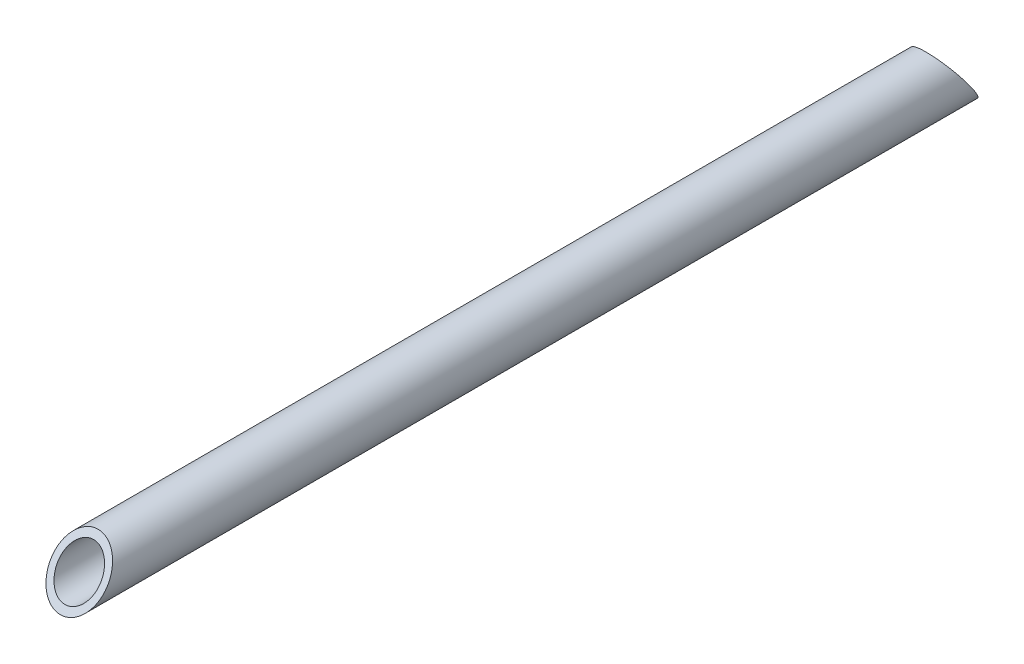
ISO-10303-21;
HEADER;
FILE_DESCRIPTION(('STEP AP214'),'2;1');
FILE_NAME('part.step','',(''),(''),'','','');
FILE_SCHEMA(('AUTOMOTIVE_DESIGN { 1 0 10303 214 1 1 1 1 }'));
ENDSEC;
DATA;
#1=APPLICATION_CONTEXT('core data for automotive mechanical design processes');
#2=APPLICATION_PROTOCOL_DEFINITION('international standard','automotive_design',2000,#1);
#3=PRODUCT_CONTEXT('',#1,'mechanical');
#4=PRODUCT('Part','Part','',(#3));
#5=PRODUCT_RELATED_PRODUCT_CATEGORY('part','',(#4));
#6=PRODUCT_DEFINITION_FORMATION('','',#4);
#7=PRODUCT_DEFINITION_CONTEXT('part definition',#1,'design');
#8=PRODUCT_DEFINITION('design','',#6,#7);
#9=PRODUCT_DEFINITION_SHAPE('','',#8);
#10=(LENGTH_UNIT() NAMED_UNIT(*) SI_UNIT(.MILLI.,.METRE.));
#11=(NAMED_UNIT(*) PLANE_ANGLE_UNIT() SI_UNIT($,.RADIAN.));
#12=(NAMED_UNIT(*) SI_UNIT($,.STERADIAN.) SOLID_ANGLE_UNIT());
#13=UNCERTAINTY_MEASURE_WITH_UNIT(LENGTH_MEASURE(1.E-05),#10,'distance_accuracy_value','');
#14=(GEOMETRIC_REPRESENTATION_CONTEXT(3) GLOBAL_UNCERTAINTY_ASSIGNED_CONTEXT((#13)) GLOBAL_UNIT_ASSIGNED_CONTEXT((#10,
#11,#12)) REPRESENTATION_CONTEXT('',''));
#15=CARTESIAN_POINT('',(0.,0.,0.));
#16=DIRECTION('',(0.,0.,1.));
#17=DIRECTION('',(1.,0.,0.));
#18=AXIS2_PLACEMENT_3D('',#15,#16,#17);
#19=CARTESIAN_POINT('',(900.,0.,-200.));
#20=DIRECTION('',(0.,0.,1.));
#21=DIRECTION('',(1.,0.,0.));
#22=AXIS2_PLACEMENT_3D('',#19,#20,#21);
#23=CYLINDRICAL_SURFACE('',#22,9.65000000000003);
#24=CARTESIAN_POINT('',(899.999999999994,3.16020998942515E-13,200.));
#25=DIRECTION('',(0.00452209739097393,-0.569208602813939,-0.8221807083104));
#26=DIRECTION('',(0.00653163689332533,-0.82215476331241,0.569226565509912));
#27=AXIS2_PLACEMENT_3D('',#24,#25,#26);
#28=ELLIPSE('',#27,11.7370790903511,9.65000000000003);
#29=CARTESIAN_POINT('',(900.0766623388,-9.6496954815063,206.681057219719));
#30=VERTEX_POINT('',#29);
#31=EDGE_CURVE('E47',#30,#30,#28,.T.);
#32=ORIENTED_EDGE('',*,*,#31,.F.);
#33=EDGE_LOOP('',(#32));
#34=FACE_BOUND('',#33,.T.);
#35=CARTESIAN_POINT('',(900.,0.,-200.));
#36=DIRECTION('',(0.00452209739098861,-0.569208602813942,0.822180708310397));
#37=DIRECTION('',(-0.00653163689339617,0.822154763312406,0.569226565509915));
#38=AXIS2_PLACEMENT_3D('',#35,#36,#37);
#39=ELLIPSE('',#38,11.7370790903511,9.65000000000003);
#40=CARTESIAN_POINT('',(899.923337661192,9.64969548150662,-193.318942780281));
#41=VERTEX_POINT('',#40);
#42=EDGE_CURVE('E60',#41,#41,#39,.T.);
#43=ORIENTED_EDGE('',*,*,#42,.F.);
#44=EDGE_LOOP('',(#43));
#45=FACE_BOUND('',#44,.T.);
#46=ADVANCED_FACE('F40',(#34,#45),#23,.F.);
#47=CARTESIAN_POINT('',(900.,0.,-200.));
#48=DIRECTION('',(0.00452209739098861,-0.569208602813942,0.822180708310397));
#49=DIRECTION('',(0.,-0.822189114975954,-0.569214422880392));
#50=AXIS2_PLACEMENT_3D('',#47,#48,#49);
#51=PLANE('',#50);
#52=ORIENTED_EDGE('',*,*,#42,.T.);
#53=EDGE_LOOP('',(#52));
#54=FACE_BOUND('',#53,.T.);
#55=CARTESIAN_POINT('',(900.,0.,-200.));
#56=DIRECTION('',(0.00452209739098861,-0.569208602813942,0.822180708310397));
#57=DIRECTION('',(-0.00653163689339617,0.822154763312406,0.569226565509915));
#58=AXIS2_PLACEMENT_3D('',#55,#56,#57);
#59=ELLIPSE('',#58,15.4467258494776,12.7);
#60=CARTESIAN_POINT('',(899.899107595559,12.6995992347289,-191.207313296329));
#61=VERTEX_POINT('',#60);
#62=EDGE_CURVE('E53',#61,#61,#59,.T.);
#63=ORIENTED_EDGE('',*,*,#62,.F.);
#64=EDGE_LOOP('',(#63));
#65=FACE_BOUND('',#64,.T.);
#66=ADVANCED_FACE('F67',(#54,#65),#51,.F.);
#67=CARTESIAN_POINT('',(900.,0.,-200.));
#68=DIRECTION('',(0.,0.,1.));
#69=DIRECTION('',(1.,0.,0.));
#70=AXIS2_PLACEMENT_3D('',#67,#68,#69);
#71=CYLINDRICAL_SURFACE('',#70,12.7);
#72=CARTESIAN_POINT('',(899.999999999994,3.16020998942515E-13,200.));
#73=DIRECTION('',(0.00452209739097393,-0.569208602813939,-0.8221807083104));
#74=DIRECTION('',(0.00653163689332533,-0.82215476331241,0.569226565509912));
#75=AXIS2_PLACEMENT_3D('',#72,#73,#74);
#76=ELLIPSE('',#75,15.4467258494775,12.7);
#77=CARTESIAN_POINT('',(900.100892404434,-12.6995992347286,208.792686703671));
#78=VERTEX_POINT('',#77);
#79=EDGE_CURVE('E10',#78,#78,#76,.T.);
#80=ORIENTED_EDGE('',*,*,#79,.T.);
#81=EDGE_LOOP('',(#80));
#82=FACE_BOUND('',#81,.T.);
#83=ORIENTED_EDGE('',*,*,#62,.T.);
#84=EDGE_LOOP('',(#83));
#85=FACE_BOUND('',#84,.T.);
#86=ADVANCED_FACE('F75',(#82,#85),#71,.T.);
#87=CARTESIAN_POINT('',(899.999999999994,3.47701307552628E-13,200.));
#88=DIRECTION('',(0.00452209739097393,-0.569208602813939,-0.8221807083104));
#89=DIRECTION('',(0.,0.822189114975957,-0.569214422880388));
#90=AXIS2_PLACEMENT_3D('',#87,#88,#89);
#91=PLANE('',#90);
#92=ORIENTED_EDGE('',*,*,#31,.T.);
#93=EDGE_LOOP('',(#92));
#94=FACE_BOUND('',#93,.T.);
#95=ORIENTED_EDGE('',*,*,#79,.F.);
#96=EDGE_LOOP('',(#95));
#97=FACE_BOUND('',#96,.T.);
#98=ADVANCED_FACE('F80',(#94,#97),#91,.F.);
#99=CLOSED_SHELL('',(#46,#66,#86,#98));
#100=MANIFOLD_SOLID_BREP('B2',#99);
#101=ADVANCED_BREP_SHAPE_REPRESENTATION('',(#18,#100),#14);
#102=SHAPE_DEFINITION_REPRESENTATION(#9,#101);
ENDSEC;
END-ISO-10303-21;
